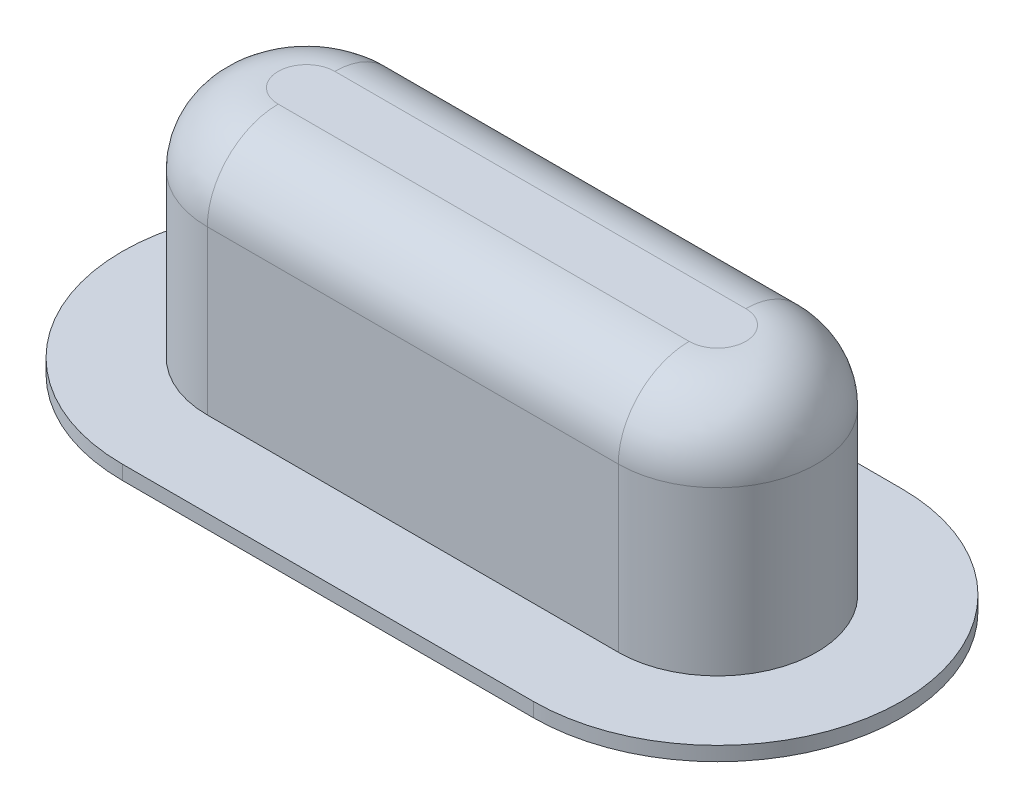
ISO-10303-21;
HEADER;
FILE_DESCRIPTION(('STEP AP214'),'2;1');
FILE_NAME('part.step','',(''),(''),'','','');
FILE_SCHEMA(('AUTOMOTIVE_DESIGN { 1 0 10303 214 1 1 1 1 }'));
ENDSEC;
DATA;
#1=APPLICATION_CONTEXT('core data for automotive mechanical design processes');
#2=APPLICATION_PROTOCOL_DEFINITION('international standard','automotive_design',2000,#1);
#3=PRODUCT_CONTEXT('',#1,'mechanical');
#4=PRODUCT('Part','Part','',(#3));
#5=PRODUCT_RELATED_PRODUCT_CATEGORY('part','',(#4));
#6=PRODUCT_DEFINITION_FORMATION('','',#4);
#7=PRODUCT_DEFINITION_CONTEXT('part definition',#1,'design');
#8=PRODUCT_DEFINITION('design','',#6,#7);
#9=PRODUCT_DEFINITION_SHAPE('','',#8);
#10=(LENGTH_UNIT() NAMED_UNIT(*) SI_UNIT(.MILLI.,.METRE.));
#11=(NAMED_UNIT(*) PLANE_ANGLE_UNIT() SI_UNIT($,.RADIAN.));
#12=(NAMED_UNIT(*) SI_UNIT($,.STERADIAN.) SOLID_ANGLE_UNIT());
#13=UNCERTAINTY_MEASURE_WITH_UNIT(LENGTH_MEASURE(1.E-05),#10,'distance_accuracy_value','');
#14=(GEOMETRIC_REPRESENTATION_CONTEXT(3) GLOBAL_UNCERTAINTY_ASSIGNED_CONTEXT((#13)) GLOBAL_UNIT_ASSIGNED_CONTEXT((#10,
#11,#12)) REPRESENTATION_CONTEXT('',''));
#15=CARTESIAN_POINT('',(0.,0.,0.));
#16=DIRECTION('',(0.,0.,1.));
#17=DIRECTION('',(1.,0.,0.));
#18=AXIS2_PLACEMENT_3D('',#15,#16,#17);
#19=CARTESIAN_POINT('',(-29.,0.,0.));
#20=DIRECTION('',(0.,1.,0.));
#21=DIRECTION('',(0.,0.,1.));
#22=AXIS2_PLACEMENT_3D('',#19,#20,#21);
#23=PLANE('',#22);
#24=DIRECTION('',(-1.,0.,0.));
#25=VECTOR('',#24,1.);
#26=CARTESIAN_POINT('',(-29.,0.,-10.));
#27=LINE('',#26,#25);
#28=CARTESIAN_POINT('',(29.,0.,-10.));
#29=VERTEX_POINT('',#28);
#30=CARTESIAN_POINT('',(-29.,0.,-10.));
#31=VERTEX_POINT('',#30);
#32=EDGE_CURVE('E243',#29,#31,#27,.T.);
#33=ORIENTED_EDGE('',*,*,#32,.T.);
#34=CARTESIAN_POINT('',(-29.,0.,0.));
#35=DIRECTION('',(0.,1.,0.));
#36=DIRECTION('',(0.,0.,1.));
#37=AXIS2_PLACEMENT_3D('',#34,#35,#36);
#38=CIRCLE('',#37,10.);
#39=CARTESIAN_POINT('',(-29.,0.,10.));
#40=VERTEX_POINT('',#39);
#41=EDGE_CURVE('E262',#31,#40,#38,.T.);
#42=ORIENTED_EDGE('',*,*,#41,.T.);
#43=DIRECTION('',(1.,0.,0.));
#44=VECTOR('',#43,1.);
#45=CARTESIAN_POINT('',(-29.,0.,10.));
#46=LINE('',#45,#44);
#47=CARTESIAN_POINT('',(29.,0.,10.));
#48=VERTEX_POINT('',#47);
#49=EDGE_CURVE('E286',#40,#48,#46,.T.);
#50=ORIENTED_EDGE('',*,*,#49,.T.);
#51=CARTESIAN_POINT('',(29.,0.,0.));
#52=DIRECTION('',(0.,1.,0.));
#53=DIRECTION('',(0.,0.,1.));
#54=AXIS2_PLACEMENT_3D('',#51,#52,#53);
#55=CIRCLE('',#54,10.);
#56=EDGE_CURVE('E290',#48,#29,#55,.T.);
#57=ORIENTED_EDGE('',*,*,#56,.T.);
#58=EDGE_LOOP('',(#33,#42,#50,#57));
#59=FACE_BOUND('',#58,.T.);
#60=CARTESIAN_POINT('',(-29.,0.,0.));
#61=DIRECTION('',(0.,-1.,0.));
#62=DIRECTION('',(0.,0.,-1.));
#63=AXIS2_PLACEMENT_3D('',#60,#61,#62);
#64=CIRCLE('',#63,26.);
#65=CARTESIAN_POINT('',(-29.,0.,26.));
#66=VERTEX_POINT('',#65);
#67=CARTESIAN_POINT('',(-29.,0.,-26.));
#68=VERTEX_POINT('',#67);
#69=EDGE_CURVE('E201',#66,#68,#64,.T.);
#70=ORIENTED_EDGE('',*,*,#69,.T.);
#71=DIRECTION('',(1.,0.,0.));
#72=VECTOR('',#71,1.);
#73=CARTESIAN_POINT('',(-29.,0.,-26.));
#74=LINE('',#73,#72);
#75=CARTESIAN_POINT('',(29.,0.,-26.));
#76=VERTEX_POINT('',#75);
#77=EDGE_CURVE('E166',#68,#76,#74,.T.);
#78=ORIENTED_EDGE('',*,*,#77,.T.);
#79=CARTESIAN_POINT('',(29.,0.,0.));
#80=DIRECTION('',(0.,-1.,0.));
#81=DIRECTION('',(0.,0.,-1.));
#82=AXIS2_PLACEMENT_3D('',#79,#80,#81);
#83=CIRCLE('',#82,26.);
#84=CARTESIAN_POINT('',(29.,0.,26.));
#85=VERTEX_POINT('',#84);
#86=EDGE_CURVE('E194',#76,#85,#83,.T.);
#87=ORIENTED_EDGE('',*,*,#86,.T.);
#88=DIRECTION('',(-1.,0.,0.));
#89=VECTOR('',#88,1.);
#90=CARTESIAN_POINT('',(29.,0.,26.));
#91=LINE('',#90,#89);
#92=EDGE_CURVE('E190',#85,#66,#91,.T.);
#93=ORIENTED_EDGE('',*,*,#92,.T.);
#94=EDGE_LOOP('',(#70,#78,#87,#93));
#95=FACE_BOUND('',#94,.T.);
#96=ADVANCED_FACE('F43',(#59,#95),#23,.F.);
#97=CARTESIAN_POINT('',(-29.,35.,0.));
#98=DIRECTION('',(0.,-1.,0.));
#99=DIRECTION('',(0.,0.,-1.));
#100=AXIS2_PLACEMENT_3D('',#97,#98,#99);
#101=CYLINDRICAL_SURFACE('',#100,10.);
#102=ORIENTED_EDGE('',*,*,#41,.F.);
#103=DIRECTION('',(0.,-1.,0.));
#104=VECTOR('',#103,1.);
#105=CARTESIAN_POINT('',(-29.,35.,-10.));
#106=LINE('',#105,#104);
#107=CARTESIAN_POINT('',(-29.,25.,-10.));
#108=VERTEX_POINT('',#107);
#109=EDGE_CURVE('E239',#108,#31,#106,.T.);
#110=ORIENTED_EDGE('',*,*,#109,.F.);
#111=CARTESIAN_POINT('',(-29.,25.,0.));
#112=DIRECTION('',(0.,-1.,0.));
#113=DIRECTION('',(0.,0.,-1.));
#114=AXIS2_PLACEMENT_3D('',#111,#112,#113);
#115=CIRCLE('',#114,10.);
#116=CARTESIAN_POINT('',(-29.,25.,10.));
#117=VERTEX_POINT('',#116);
#118=EDGE_CURVE('E234',#117,#108,#115,.T.);
#119=ORIENTED_EDGE('',*,*,#118,.F.);
#120=DIRECTION('',(0.,1.,0.));
#121=VECTOR('',#120,1.);
#122=CARTESIAN_POINT('',(-29.,35.,10.));
#123=LINE('',#122,#121);
#124=EDGE_CURVE('E229',#117,#40,#123,.F.);
#125=ORIENTED_EDGE('',*,*,#124,.T.);
#126=EDGE_LOOP('',(#102,#110,#119,#125));
#127=FACE_BOUND('',#126,.T.);
#128=ADVANCED_FACE('F379',(#127),#101,.F.);
#129=CARTESIAN_POINT('',(-29.,35.,10.));
#130=DIRECTION('',(0.,0.,-1.));
#131=DIRECTION('',(-1.,0.,0.));
#132=AXIS2_PLACEMENT_3D('',#129,#130,#131);
#133=PLANE('',#132);
#134=ORIENTED_EDGE('',*,*,#49,.F.);
#135=ORIENTED_EDGE('',*,*,#124,.F.);
#136=DIRECTION('',(-1.,0.,0.));
#137=VECTOR('',#136,1.);
#138=CARTESIAN_POINT('',(-29.,25.,10.));
#139=LINE('',#138,#137);
#140=CARTESIAN_POINT('',(29.,25.,10.));
#141=VERTEX_POINT('',#140);
#142=EDGE_CURVE('E238',#141,#117,#139,.T.);
#143=ORIENTED_EDGE('',*,*,#142,.F.);
#144=DIRECTION('',(0.,-1.,0.));
#145=VECTOR('',#144,1.);
#146=CARTESIAN_POINT('',(29.,35.,10.));
#147=LINE('',#146,#145);
#148=EDGE_CURVE('E233',#141,#48,#147,.T.);
#149=ORIENTED_EDGE('',*,*,#148,.T.);
#150=EDGE_LOOP('',(#134,#135,#143,#149));
#151=FACE_BOUND('',#150,.T.);
#152=ADVANCED_FACE('F384',(#151),#133,.T.);
#153=CARTESIAN_POINT('',(29.,35.,0.));
#154=DIRECTION('',(0.,-1.,0.));
#155=DIRECTION('',(0.,0.,-1.));
#156=AXIS2_PLACEMENT_3D('',#153,#154,#155);
#157=CYLINDRICAL_SURFACE('',#156,10.);
#158=ORIENTED_EDGE('',*,*,#56,.F.);
#159=ORIENTED_EDGE('',*,*,#148,.F.);
#160=CARTESIAN_POINT('',(29.,25.,0.));
#161=DIRECTION('',(0.,-1.,0.));
#162=DIRECTION('',(0.,0.,-1.));
#163=AXIS2_PLACEMENT_3D('',#160,#161,#162);
#164=CIRCLE('',#163,10.);
#165=CARTESIAN_POINT('',(29.,25.,-10.));
#166=VERTEX_POINT('',#165);
#167=EDGE_CURVE('E248',#166,#141,#164,.T.);
#168=ORIENTED_EDGE('',*,*,#167,.F.);
#169=DIRECTION('',(0.,1.,0.));
#170=VECTOR('',#169,1.);
#171=CARTESIAN_POINT('',(29.,35.,-10.));
#172=LINE('',#171,#170);
#173=EDGE_CURVE('E242',#166,#29,#172,.F.);
#174=ORIENTED_EDGE('',*,*,#173,.T.);
#175=EDGE_LOOP('',(#158,#159,#168,#174));
#176=FACE_BOUND('',#175,.T.);
#177=ADVANCED_FACE('F502',(#176),#157,.F.);
#178=CARTESIAN_POINT('',(-29.,35.,-10.));
#179=DIRECTION('',(0.,0.,1.));
#180=DIRECTION('',(1.,0.,0.));
#181=AXIS2_PLACEMENT_3D('',#178,#179,#180);
#182=PLANE('',#181);
#183=ORIENTED_EDGE('',*,*,#32,.F.);
#184=ORIENTED_EDGE('',*,*,#173,.F.);
#185=DIRECTION('',(1.,0.,0.));
#186=VECTOR('',#185,1.);
#187=CARTESIAN_POINT('',(-29.,25.,-10.));
#188=LINE('',#187,#186);
#189=EDGE_CURVE('E253',#108,#166,#188,.T.);
#190=ORIENTED_EDGE('',*,*,#189,.F.);
#191=ORIENTED_EDGE('',*,*,#109,.T.);
#192=EDGE_LOOP('',(#183,#184,#190,#191));
#193=FACE_BOUND('',#192,.T.);
#194=ADVANCED_FACE('F432',(#193),#182,.T.);
#195=CARTESIAN_POINT('',(-29.,31.,0.));
#196=DIRECTION('',(0.,1.,0.));
#197=DIRECTION('',(0.,0.,1.));
#198=AXIS2_PLACEMENT_3D('',#195,#196,#197);
#199=PLANE('',#198);
#200=CARTESIAN_POINT('',(29.,31.,0.));
#201=DIRECTION('',(0.,1.,0.));
#202=DIRECTION('',(0.,0.,1.));
#203=AXIS2_PLACEMENT_3D('',#200,#201,#202);
#204=CIRCLE('',#203,4.);
#205=CARTESIAN_POINT('',(29.,31.,4.00000000000001));
#206=VERTEX_POINT('',#205);
#207=CARTESIAN_POINT('',(29.,31.,-4.));
#208=VERTEX_POINT('',#207);
#209=EDGE_CURVE('E267',#206,#208,#204,.T.);
#210=ORIENTED_EDGE('',*,*,#209,.F.);
#211=DIRECTION('',(1.,0.,0.));
#212=VECTOR('',#211,1.);
#213=CARTESIAN_POINT('',(-29.,31.,4.00000000000001));
#214=LINE('',#213,#212);
#215=CARTESIAN_POINT('',(-29.,31.,4.00000000000001));
#216=VERTEX_POINT('',#215);
#217=EDGE_CURVE('E270',#216,#206,#214,.T.);
#218=ORIENTED_EDGE('',*,*,#217,.F.);
#219=CARTESIAN_POINT('',(-29.,31.,0.));
#220=DIRECTION('',(0.,1.,0.));
#221=DIRECTION('',(0.,0.,1.));
#222=AXIS2_PLACEMENT_3D('',#219,#220,#221);
#223=CIRCLE('',#222,4.);
#224=CARTESIAN_POINT('',(-29.,31.,-4.));
#225=VERTEX_POINT('',#224);
#226=EDGE_CURVE('E232',#225,#216,#223,.T.);
#227=ORIENTED_EDGE('',*,*,#226,.F.);
#228=DIRECTION('',(1.,0.,0.));
#229=VECTOR('',#228,1.);
#230=CARTESIAN_POINT('',(-29.,31.,-4.));
#231=LINE('',#230,#229);
#232=EDGE_CURVE('E257',#208,#225,#231,.F.);
#233=ORIENTED_EDGE('',*,*,#232,.F.);
#234=EDGE_LOOP('',(#210,#218,#227,#233));
#235=FACE_BOUND('',#234,.T.);
#236=ADVANCED_FACE('F426',(#235),#199,.F.);
#237=CARTESIAN_POINT('',(-29.,25.,4.00000000000001));
#238=DIRECTION('',(-1.,0.,0.));
#239=DIRECTION('',(0.,0.,1.));
#240=AXIS2_PLACEMENT_3D('',#237,#238,#239);
#241=CYLINDRICAL_SURFACE('',#240,6.);
#242=CARTESIAN_POINT('',(-29.,25.,4.00000000000001));
#243=DIRECTION('',(-1.,0.,0.));
#244=DIRECTION('',(0.,0.,1.));
#245=AXIS2_PLACEMENT_3D('',#242,#243,#244);
#246=CIRCLE('',#245,6.);
#247=EDGE_CURVE('E263',#117,#216,#246,.T.);
#248=ORIENTED_EDGE('',*,*,#247,.T.);
#249=ORIENTED_EDGE('',*,*,#217,.T.);
#250=CARTESIAN_POINT('',(29.,25.,4.00000000000001));
#251=DIRECTION('',(-1.,0.,0.));
#252=DIRECTION('',(0.,0.,1.));
#253=AXIS2_PLACEMENT_3D('',#250,#251,#252);
#254=CIRCLE('',#253,6.);
#255=EDGE_CURVE('E258',#206,#141,#254,.F.);
#256=ORIENTED_EDGE('',*,*,#255,.T.);
#257=ORIENTED_EDGE('',*,*,#142,.T.);
#258=EDGE_LOOP('',(#248,#249,#256,#257));
#259=FACE_BOUND('',#258,.T.);
#260=ADVANCED_FACE('F431',(#259),#241,.F.);
#261=CARTESIAN_POINT('',(29.,25.,0.));
#262=DIRECTION('',(0.,1.,0.));
#263=DIRECTION('',(0.,0.,1.));
#264=AXIS2_PLACEMENT_3D('',#261,#262,#263);
#265=DEGENERATE_TOROIDAL_SURFACE('',#264,4.00000000000001,6.,.T.);
#266=ORIENTED_EDGE('',*,*,#255,.F.);
#267=ORIENTED_EDGE('',*,*,#209,.T.);
#268=CARTESIAN_POINT('',(29.,25.,-4.00000000000001));
#269=DIRECTION('',(1.,0.,0.));
#270=DIRECTION('',(0.,0.,-1.));
#271=AXIS2_PLACEMENT_3D('',#268,#269,#270);
#272=CIRCLE('',#271,6.);
#273=EDGE_CURVE('E264',#208,#166,#272,.F.);
#274=ORIENTED_EDGE('',*,*,#273,.T.);
#275=ORIENTED_EDGE('',*,*,#167,.T.);
#276=EDGE_LOOP('',(#266,#267,#274,#275));
#277=FACE_BOUND('',#276,.T.);
#278=ADVANCED_FACE('F445',(#277),#265,.F.);
#279=CARTESIAN_POINT('',(-29.,25.,0.));
#280=DIRECTION('',(0.,1.,0.));
#281=DIRECTION('',(0.,0.,1.));
#282=AXIS2_PLACEMENT_3D('',#279,#280,#281);
#283=DEGENERATE_TOROIDAL_SURFACE('',#282,4.00000000000001,6.,.T.);
#284=ORIENTED_EDGE('',*,*,#247,.F.);
#285=ORIENTED_EDGE('',*,*,#118,.T.);
#286=CARTESIAN_POINT('',(-29.,25.,-4.00000000000001));
#287=DIRECTION('',(1.,0.,0.));
#288=DIRECTION('',(0.,0.,-1.));
#289=AXIS2_PLACEMENT_3D('',#286,#287,#288);
#290=CIRCLE('',#289,6.);
#291=EDGE_CURVE('E228',#108,#225,#290,.T.);
#292=ORIENTED_EDGE('',*,*,#291,.T.);
#293=ORIENTED_EDGE('',*,*,#226,.T.);
#294=EDGE_LOOP('',(#284,#285,#292,#293));
#295=FACE_BOUND('',#294,.T.);
#296=ADVANCED_FACE('F456',(#295),#283,.F.);
#297=CARTESIAN_POINT('',(-29.,25.,-4.00000000000001));
#298=DIRECTION('',(1.,0.,0.));
#299=DIRECTION('',(0.,0.,-1.));
#300=AXIS2_PLACEMENT_3D('',#297,#298,#299);
#301=CYLINDRICAL_SURFACE('',#300,6.);
#302=ORIENTED_EDGE('',*,*,#273,.F.);
#303=ORIENTED_EDGE('',*,*,#232,.T.);
#304=ORIENTED_EDGE('',*,*,#291,.F.);
#305=ORIENTED_EDGE('',*,*,#189,.T.);
#306=EDGE_LOOP('',(#302,#303,#304,#305));
#307=FACE_BOUND('',#306,.T.);
#308=ADVANCED_FACE('F467',(#307),#301,.F.);
#309=CARTESIAN_POINT('',(-29.,2.,0.));
#310=DIRECTION('',(0.,-1.,0.));
#311=DIRECTION('',(0.,0.,-1.));
#312=AXIS2_PLACEMENT_3D('',#309,#310,#311);
#313=PLANE('',#312);
#314=CARTESIAN_POINT('',(-29.,2.,0.));
#315=DIRECTION('',(0.,-1.,0.));
#316=DIRECTION('',(0.,0.,-1.));
#317=AXIS2_PLACEMENT_3D('',#314,#315,#316);
#318=CIRCLE('',#317,26.);
#319=CARTESIAN_POINT('',(-29.,2.,26.));
#320=VERTEX_POINT('',#319);
#321=CARTESIAN_POINT('',(-29.,2.,-26.));
#322=VERTEX_POINT('',#321);
#323=EDGE_CURVE('E181',#320,#322,#318,.T.);
#324=ORIENTED_EDGE('',*,*,#323,.F.);
#325=DIRECTION('',(-1.,0.,0.));
#326=VECTOR('',#325,1.);
#327=CARTESIAN_POINT('',(29.,2.,26.));
#328=LINE('',#327,#326);
#329=CARTESIAN_POINT('',(29.,2.,26.));
#330=VERTEX_POINT('',#329);
#331=EDGE_CURVE('E173',#330,#320,#328,.T.);
#332=ORIENTED_EDGE('',*,*,#331,.F.);
#333=CARTESIAN_POINT('',(29.,2.,0.));
#334=DIRECTION('',(0.,-1.,0.));
#335=DIRECTION('',(0.,0.,-1.));
#336=AXIS2_PLACEMENT_3D('',#333,#334,#335);
#337=CIRCLE('',#336,26.);
#338=CARTESIAN_POINT('',(29.,2.,-26.));
#339=VERTEX_POINT('',#338);
#340=EDGE_CURVE('E184',#339,#330,#337,.T.);
#341=ORIENTED_EDGE('',*,*,#340,.F.);
#342=DIRECTION('',(1.,0.,0.));
#343=VECTOR('',#342,1.);
#344=CARTESIAN_POINT('',(-29.,2.,-26.));
#345=LINE('',#344,#343);
#346=EDGE_CURVE('E164',#322,#339,#345,.T.);
#347=ORIENTED_EDGE('',*,*,#346,.F.);
#348=EDGE_LOOP('',(#324,#332,#341,#347));
#349=FACE_BOUND('',#348,.T.);
#350=DIRECTION('',(-1.,0.,0.));
#351=VECTOR('',#350,1.);
#352=CARTESIAN_POINT('',(-29.,2.,14.));
#353=LINE('',#352,#351);
#354=CARTESIAN_POINT('',(29.,2.,14.));
#355=VERTEX_POINT('',#354);
#356=CARTESIAN_POINT('',(-29.,2.,14.));
#357=VERTEX_POINT('',#356);
#358=EDGE_CURVE('E68',#355,#357,#353,.T.);
#359=ORIENTED_EDGE('',*,*,#358,.T.);
#360=CARTESIAN_POINT('',(-29.,2.,0.));
#361=DIRECTION('',(0.,-1.,0.));
#362=DIRECTION('',(0.,0.,-1.));
#363=AXIS2_PLACEMENT_3D('',#360,#361,#362);
#364=CIRCLE('',#363,14.);
#365=CARTESIAN_POINT('',(-29.,2.,-14.));
#366=VERTEX_POINT('',#365);
#367=EDGE_CURVE('E61',#357,#366,#364,.T.);
#368=ORIENTED_EDGE('',*,*,#367,.T.);
#369=DIRECTION('',(1.,0.,0.));
#370=VECTOR('',#369,1.);
#371=CARTESIAN_POINT('',(-29.,2.,-14.));
#372=LINE('',#371,#370);
#373=CARTESIAN_POINT('',(29.,2.,-14.));
#374=VERTEX_POINT('',#373);
#375=EDGE_CURVE('E211',#366,#374,#372,.T.);
#376=ORIENTED_EDGE('',*,*,#375,.T.);
#377=CARTESIAN_POINT('',(29.,2.,0.));
#378=DIRECTION('',(0.,-1.,0.));
#379=DIRECTION('',(0.,0.,-1.));
#380=AXIS2_PLACEMENT_3D('',#377,#378,#379);
#381=CIRCLE('',#380,14.);
#382=EDGE_CURVE('E220',#374,#355,#381,.T.);
#383=ORIENTED_EDGE('',*,*,#382,.T.);
#384=EDGE_LOOP('',(#359,#368,#376,#383));
#385=FACE_BOUND('',#384,.T.);
#386=ADVANCED_FACE('F178',(#349,#385),#313,.F.);
#387=CARTESIAN_POINT('',(-29.,2.,0.));
#388=DIRECTION('',(0.,-1.,0.));
#389=DIRECTION('',(0.,0.,-1.));
#390=AXIS2_PLACEMENT_3D('',#387,#388,#389);
#391=CYLINDRICAL_SURFACE('',#390,26.);
#392=ORIENTED_EDGE('',*,*,#69,.F.);
#393=DIRECTION('',(0.,-1.,0.));
#394=VECTOR('',#393,1.);
#395=CARTESIAN_POINT('',(-29.,2.,26.));
#396=LINE('',#395,#394);
#397=EDGE_CURVE('E188',#320,#66,#396,.T.);
#398=ORIENTED_EDGE('',*,*,#397,.F.);
#399=ORIENTED_EDGE('',*,*,#323,.T.);
#400=DIRECTION('',(0.,-1.,0.));
#401=VECTOR('',#400,1.);
#402=CARTESIAN_POINT('',(-29.,2.,-26.));
#403=LINE('',#402,#401);
#404=EDGE_CURVE('E161',#322,#68,#403,.T.);
#405=ORIENTED_EDGE('',*,*,#404,.T.);
#406=EDGE_LOOP('',(#392,#398,#399,#405));
#407=FACE_BOUND('',#406,.T.);
#408=ADVANCED_FACE('F187',(#407),#391,.T.);
#409=CARTESIAN_POINT('',(29.,2.,26.));
#410=DIRECTION('',(0.,0.,1.));
#411=DIRECTION('',(1.,0.,0.));
#412=AXIS2_PLACEMENT_3D('',#409,#410,#411);
#413=PLANE('',#412);
#414=ORIENTED_EDGE('',*,*,#92,.F.);
#415=DIRECTION('',(0.,-1.,0.));
#416=VECTOR('',#415,1.);
#417=CARTESIAN_POINT('',(29.,2.,26.));
#418=LINE('',#417,#416);
#419=EDGE_CURVE('E212',#330,#85,#418,.T.);
#420=ORIENTED_EDGE('',*,*,#419,.F.);
#421=ORIENTED_EDGE('',*,*,#331,.T.);
#422=ORIENTED_EDGE('',*,*,#397,.T.);
#423=EDGE_LOOP('',(#414,#420,#421,#422));
#424=FACE_BOUND('',#423,.T.);
#425=ADVANCED_FACE('F538',(#424),#413,.T.);
#426=CARTESIAN_POINT('',(29.,2.,0.));
#427=DIRECTION('',(0.,-1.,0.));
#428=DIRECTION('',(0.,0.,-1.));
#429=AXIS2_PLACEMENT_3D('',#426,#427,#428);
#430=CYLINDRICAL_SURFACE('',#429,26.);
#431=ORIENTED_EDGE('',*,*,#86,.F.);
#432=DIRECTION('',(0.,-1.,0.));
#433=VECTOR('',#432,1.);
#434=CARTESIAN_POINT('',(29.,2.,-26.));
#435=LINE('',#434,#433);
#436=EDGE_CURVE('E172',#339,#76,#435,.T.);
#437=ORIENTED_EDGE('',*,*,#436,.F.);
#438=ORIENTED_EDGE('',*,*,#340,.T.);
#439=ORIENTED_EDGE('',*,*,#419,.T.);
#440=EDGE_LOOP('',(#431,#437,#438,#439));
#441=FACE_BOUND('',#440,.T.);
#442=ADVANCED_FACE('F374',(#441),#430,.T.);
#443=CARTESIAN_POINT('',(-29.,2.,-26.));
#444=DIRECTION('',(0.,0.,-1.));
#445=DIRECTION('',(-1.,0.,0.));
#446=AXIS2_PLACEMENT_3D('',#443,#444,#445);
#447=PLANE('',#446);
#448=ORIENTED_EDGE('',*,*,#77,.F.);
#449=ORIENTED_EDGE('',*,*,#404,.F.);
#450=ORIENTED_EDGE('',*,*,#346,.T.);
#451=ORIENTED_EDGE('',*,*,#436,.T.);
#452=EDGE_LOOP('',(#448,#449,#450,#451));
#453=FACE_BOUND('',#452,.T.);
#454=ADVANCED_FACE('F163',(#453),#447,.T.);
#455=CARTESIAN_POINT('',(-29.,35.,0.));
#456=DIRECTION('',(0.,1.,0.));
#457=DIRECTION('',(0.,0.,1.));
#458=AXIS2_PLACEMENT_3D('',#455,#456,#457);
#459=PLANE('',#458);
#460=CARTESIAN_POINT('',(29.,35.,0.));
#461=DIRECTION('',(0.,1.,0.));
#462=DIRECTION('',(0.,0.,1.));
#463=AXIS2_PLACEMENT_3D('',#460,#461,#462);
#464=CIRCLE('',#463,4.00000000000001);
#465=CARTESIAN_POINT('',(29.,35.,4.00000000000001));
#466=VERTEX_POINT('',#465);
#467=CARTESIAN_POINT('',(29.,35.,-4.));
#468=VERTEX_POINT('',#467);
#469=EDGE_CURVE('E315',#466,#468,#464,.T.);
#470=ORIENTED_EDGE('',*,*,#469,.T.);
#471=DIRECTION('',(-1.,0.,0.));
#472=VECTOR('',#471,1.);
#473=CARTESIAN_POINT('',(-29.,35.,-4.00000000000001));
#474=LINE('',#473,#472);
#475=CARTESIAN_POINT('',(-29.,35.,-4.));
#476=VERTEX_POINT('',#475);
#477=EDGE_CURVE('E318',#468,#476,#474,.T.);
#478=ORIENTED_EDGE('',*,*,#477,.T.);
#479=CARTESIAN_POINT('',(-29.,35.,0.));
#480=DIRECTION('',(0.,1.,0.));
#481=DIRECTION('',(0.,0.,1.));
#482=AXIS2_PLACEMENT_3D('',#479,#480,#481);
#483=CIRCLE('',#482,4.00000000000001);
#484=CARTESIAN_POINT('',(-29.,35.,4.00000000000001));
#485=VERTEX_POINT('',#484);
#486=EDGE_CURVE('E309',#476,#485,#483,.T.);
#487=ORIENTED_EDGE('',*,*,#486,.T.);
#488=DIRECTION('',(1.,0.,0.));
#489=VECTOR('',#488,1.);
#490=CARTESIAN_POINT('',(29.,35.,4.00000000000001));
#491=LINE('',#490,#489);
#492=EDGE_CURVE('E312',#485,#466,#491,.T.);
#493=ORIENTED_EDGE('',*,*,#492,.T.);
#494=EDGE_LOOP('',(#470,#478,#487,#493));
#495=FACE_BOUND('',#494,.T.);
#496=ADVANCED_FACE('F366',(#495),#459,.T.);
#497=CARTESIAN_POINT('',(-29.,25.,0.));
#498=DIRECTION('',(0.,1.,0.));
#499=DIRECTION('',(0.,0.,1.));
#500=AXIS2_PLACEMENT_3D('',#497,#498,#499);
#501=DEGENERATE_TOROIDAL_SURFACE('',#500,4.00000000000001,10.,.T.);
#502=CARTESIAN_POINT('',(-29.,25.,4.00000000000001));
#503=DIRECTION('',(-1.,0.,0.));
#504=DIRECTION('',(0.,0.,1.));
#505=AXIS2_PLACEMENT_3D('',#502,#503,#504);
#506=CIRCLE('',#505,10.);
#507=CARTESIAN_POINT('',(-29.,25.,14.));
#508=VERTEX_POINT('',#507);
#509=EDGE_CURVE('E335',#508,#485,#506,.T.);
#510=ORIENTED_EDGE('',*,*,#509,.T.);
#511=ORIENTED_EDGE('',*,*,#486,.F.);
#512=CARTESIAN_POINT('',(-29.,25.,-4.));
#513=DIRECTION('',(1.,0.,0.));
#514=DIRECTION('',(0.,0.,-1.));
#515=AXIS2_PLACEMENT_3D('',#512,#513,#514);
#516=CIRCLE('',#515,10.);
#517=CARTESIAN_POINT('',(-29.,25.,-14.));
#518=VERTEX_POINT('',#517);
#519=EDGE_CURVE('E237',#518,#476,#516,.T.);
#520=ORIENTED_EDGE('',*,*,#519,.F.);
#521=CARTESIAN_POINT('',(-29.,25.,0.));
#522=DIRECTION('',(0.,1.,0.));
#523=DIRECTION('',(0.,0.,1.));
#524=AXIS2_PLACEMENT_3D('',#521,#522,#523);
#525=CIRCLE('',#524,14.);
#526=EDGE_CURVE('E11',#508,#518,#525,.F.);
#527=ORIENTED_EDGE('',*,*,#526,.F.);
#528=EDGE_LOOP('',(#510,#511,#520,#527));
#529=FACE_BOUND('',#528,.T.);
#530=ADVANCED_FACE('F364',(#529),#501,.T.);
#531=CARTESIAN_POINT('',(-29.,25.,4.00000000000001));
#532=DIRECTION('',(-1.,0.,0.));
#533=DIRECTION('',(0.,0.,1.));
#534=AXIS2_PLACEMENT_3D('',#531,#532,#533);
#535=CYLINDRICAL_SURFACE('',#534,10.);
#536=ORIENTED_EDGE('',*,*,#509,.F.);
#537=DIRECTION('',(1.,0.,0.));
#538=VECTOR('',#537,1.);
#539=CARTESIAN_POINT('',(-29.,25.,14.));
#540=LINE('',#539,#538);
#541=CARTESIAN_POINT('',(29.,25.,14.));
#542=VERTEX_POINT('',#541);
#543=EDGE_CURVE('E53',#542,#508,#540,.F.);
#544=ORIENTED_EDGE('',*,*,#543,.F.);
#545=CARTESIAN_POINT('',(29.,25.,4.00000000000001));
#546=DIRECTION('',(1.,0.,0.));
#547=DIRECTION('',(0.,0.,-1.));
#548=AXIS2_PLACEMENT_3D('',#545,#546,#547);
#549=CIRCLE('',#548,10.);
#550=EDGE_CURVE('E47',#466,#542,#549,.T.);
#551=ORIENTED_EDGE('',*,*,#550,.F.);
#552=ORIENTED_EDGE('',*,*,#492,.F.);
#553=EDGE_LOOP('',(#536,#544,#551,#552));
#554=FACE_BOUND('',#553,.T.);
#555=ADVANCED_FACE('F45',(#554),#535,.T.);
#556=CARTESIAN_POINT('',(29.,25.,0.));
#557=DIRECTION('',(0.,1.,0.));
#558=DIRECTION('',(0.,0.,1.));
#559=AXIS2_PLACEMENT_3D('',#556,#557,#558);
#560=DEGENERATE_TOROIDAL_SURFACE('',#559,4.00000000000001,10.,.T.);
#561=ORIENTED_EDGE('',*,*,#550,.T.);
#562=CARTESIAN_POINT('',(29.,25.,0.));
#563=DIRECTION('',(0.,1.,0.));
#564=DIRECTION('',(0.,0.,1.));
#565=AXIS2_PLACEMENT_3D('',#562,#563,#564);
#566=CIRCLE('',#565,14.);
#567=CARTESIAN_POINT('',(29.,25.,-14.));
#568=VERTEX_POINT('',#567);
#569=EDGE_CURVE('E326',#568,#542,#566,.F.);
#570=ORIENTED_EDGE('',*,*,#569,.F.);
#571=CARTESIAN_POINT('',(29.,25.,-4.));
#572=DIRECTION('',(-1.,0.,0.));
#573=DIRECTION('',(0.,0.,1.));
#574=AXIS2_PLACEMENT_3D('',#571,#572,#573);
#575=CIRCLE('',#574,10.);
#576=EDGE_CURVE('E333',#468,#568,#575,.T.);
#577=ORIENTED_EDGE('',*,*,#576,.F.);
#578=ORIENTED_EDGE('',*,*,#469,.F.);
#579=EDGE_LOOP('',(#561,#570,#577,#578));
#580=FACE_BOUND('',#579,.T.);
#581=ADVANCED_FACE('F348',(#580),#560,.T.);
#582=CARTESIAN_POINT('',(-29.,25.,-4.00000000000001));
#583=DIRECTION('',(1.,0.,0.));
#584=DIRECTION('',(0.,0.,-1.));
#585=AXIS2_PLACEMENT_3D('',#582,#583,#584);
#586=CYLINDRICAL_SURFACE('',#585,10.);
#587=ORIENTED_EDGE('',*,*,#576,.T.);
#588=DIRECTION('',(-1.,0.,0.));
#589=VECTOR('',#588,1.);
#590=CARTESIAN_POINT('',(29.,25.,-14.));
#591=LINE('',#590,#589);
#592=EDGE_CURVE('E322',#518,#568,#591,.F.);
#593=ORIENTED_EDGE('',*,*,#592,.F.);
#594=ORIENTED_EDGE('',*,*,#519,.T.);
#595=ORIENTED_EDGE('',*,*,#477,.F.);
#596=EDGE_LOOP('',(#587,#593,#594,#595));
#597=FACE_BOUND('',#596,.T.);
#598=ADVANCED_FACE('F362',(#597),#586,.T.);
#599=CARTESIAN_POINT('',(-29.,35.,-14.));
#600=DIRECTION('',(0.,0.,1.));
#601=DIRECTION('',(1.,0.,0.));
#602=AXIS2_PLACEMENT_3D('',#599,#600,#601);
#603=PLANE('',#602);
#604=ORIENTED_EDGE('',*,*,#375,.F.);
#605=DIRECTION('',(0.,-1.,0.));
#606=VECTOR('',#605,1.);
#607=CARTESIAN_POINT('',(-29.,35.,-14.));
#608=LINE('',#607,#606);
#609=EDGE_CURVE('E297',#518,#366,#608,.T.);
#610=ORIENTED_EDGE('',*,*,#609,.F.);
#611=ORIENTED_EDGE('',*,*,#592,.T.);
#612=DIRECTION('',(0.,-1.,0.));
#613=VECTOR('',#612,1.);
#614=CARTESIAN_POINT('',(29.,35.,-14.));
#615=LINE('',#614,#613);
#616=EDGE_CURVE('E300',#568,#374,#615,.T.);
#617=ORIENTED_EDGE('',*,*,#616,.T.);
#618=EDGE_LOOP('',(#604,#610,#611,#617));
#619=FACE_BOUND('',#618,.T.);
#620=ADVANCED_FACE('F359',(#619),#603,.F.);
#621=CARTESIAN_POINT('',(29.,35.,0.));
#622=DIRECTION('',(0.,-1.,0.));
#623=DIRECTION('',(0.,0.,-1.));
#624=AXIS2_PLACEMENT_3D('',#621,#622,#623);
#625=CYLINDRICAL_SURFACE('',#624,14.);
#626=ORIENTED_EDGE('',*,*,#382,.F.);
#627=ORIENTED_EDGE('',*,*,#616,.F.);
#628=ORIENTED_EDGE('',*,*,#569,.T.);
#629=DIRECTION('',(0.,-1.,0.));
#630=VECTOR('',#629,1.);
#631=CARTESIAN_POINT('',(29.,35.,14.));
#632=LINE('',#631,#630);
#633=EDGE_CURVE('E303',#542,#355,#632,.T.);
#634=ORIENTED_EDGE('',*,*,#633,.T.);
#635=EDGE_LOOP('',(#626,#627,#628,#634));
#636=FACE_BOUND('',#635,.T.);
#637=ADVANCED_FACE('F391',(#636),#625,.T.);
#638=CARTESIAN_POINT('',(-29.,35.,14.));
#639=DIRECTION('',(0.,0.,-1.));
#640=DIRECTION('',(-1.,0.,0.));
#641=AXIS2_PLACEMENT_3D('',#638,#639,#640);
#642=PLANE('',#641);
#643=ORIENTED_EDGE('',*,*,#358,.F.);
#644=ORIENTED_EDGE('',*,*,#633,.F.);
#645=ORIENTED_EDGE('',*,*,#543,.T.);
#646=DIRECTION('',(0.,-1.,0.));
#647=VECTOR('',#646,1.);
#648=CARTESIAN_POINT('',(-29.,35.,14.));
#649=LINE('',#648,#647);
#650=EDGE_CURVE('E306',#508,#357,#649,.T.);
#651=ORIENTED_EDGE('',*,*,#650,.T.);
#652=EDGE_LOOP('',(#643,#644,#645,#651));
#653=FACE_BOUND('',#652,.T.);
#654=ADVANCED_FACE('F353',(#653),#642,.F.);
#655=CARTESIAN_POINT('',(-29.,35.,0.));
#656=DIRECTION('',(0.,-1.,0.));
#657=DIRECTION('',(0.,0.,-1.));
#658=AXIS2_PLACEMENT_3D('',#655,#656,#657);
#659=CYLINDRICAL_SURFACE('',#658,14.);
#660=ORIENTED_EDGE('',*,*,#367,.F.);
#661=ORIENTED_EDGE('',*,*,#650,.F.);
#662=ORIENTED_EDGE('',*,*,#526,.T.);
#663=ORIENTED_EDGE('',*,*,#609,.T.);
#664=EDGE_LOOP('',(#660,#661,#662,#663));
#665=FACE_BOUND('',#664,.T.);
#666=ADVANCED_FACE('F354',(#665),#659,.T.);
#667=CLOSED_SHELL('',(#96,#128,#152,#177,#194,#236,#260,#278,#296,#308,#386,#408,#425,#442,#454,
#496,#530,#555,#581,#598,#620,#637,#654,#666));
#668=MANIFOLD_SOLID_BREP('B2',#667);
#669=ADVANCED_BREP_SHAPE_REPRESENTATION('',(#18,#668),#14);
#670=SHAPE_DEFINITION_REPRESENTATION(#9,#669);
ENDSEC;
END-ISO-10303-21;
